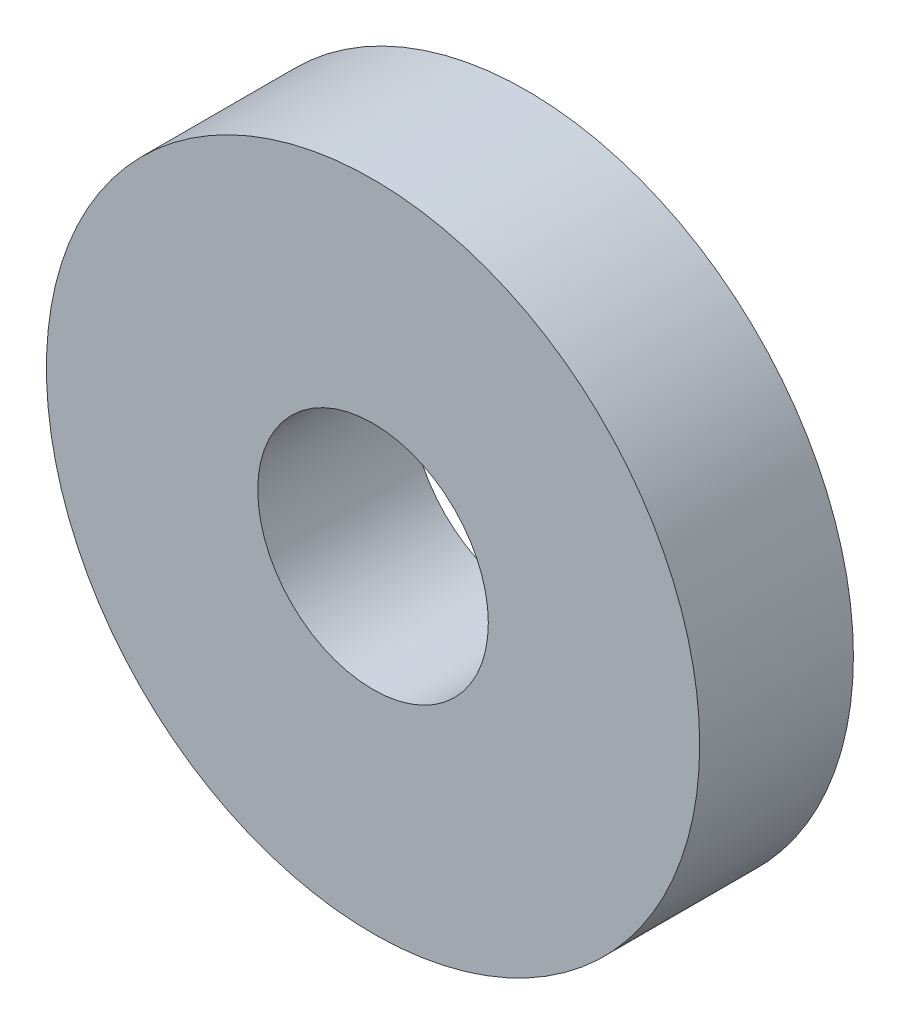
ISO-10303-21;
HEADER;
FILE_DESCRIPTION(('STEP AP214'),'2;1');
FILE_NAME('part.step','',(''),(''),'','','');
FILE_SCHEMA(('AUTOMOTIVE_DESIGN { 1 0 10303 214 1 1 1 1 }'));
ENDSEC;
DATA;
#1=APPLICATION_CONTEXT('core data for automotive mechanical design processes');
#2=APPLICATION_PROTOCOL_DEFINITION('international standard','automotive_design',2000,#1);
#3=PRODUCT_CONTEXT('',#1,'mechanical');
#4=PRODUCT('Part','Part','',(#3));
#5=PRODUCT_RELATED_PRODUCT_CATEGORY('part','',(#4));
#6=PRODUCT_DEFINITION_FORMATION('','',#4);
#7=PRODUCT_DEFINITION_CONTEXT('part definition',#1,'design');
#8=PRODUCT_DEFINITION('design','',#6,#7);
#9=PRODUCT_DEFINITION_SHAPE('','',#8);
#10=(LENGTH_UNIT() NAMED_UNIT(*) SI_UNIT(.MILLI.,.METRE.));
#11=(NAMED_UNIT(*) PLANE_ANGLE_UNIT() SI_UNIT($,.RADIAN.));
#12=(NAMED_UNIT(*) SI_UNIT($,.STERADIAN.) SOLID_ANGLE_UNIT());
#13=UNCERTAINTY_MEASURE_WITH_UNIT(LENGTH_MEASURE(1.E-05),#10,'distance_accuracy_value','');
#14=(GEOMETRIC_REPRESENTATION_CONTEXT(3) GLOBAL_UNCERTAINTY_ASSIGNED_CONTEXT((#13)) GLOBAL_UNIT_ASSIGNED_CONTEXT((#10,
#11,#12)) REPRESENTATION_CONTEXT('',''));
#15=CARTESIAN_POINT('',(0.,0.,0.));
#16=DIRECTION('',(0.,0.,1.));
#17=DIRECTION('',(1.,0.,0.));
#18=AXIS2_PLACEMENT_3D('',#15,#16,#17);
#19=CARTESIAN_POINT('',(0.,0.,4.));
#20=DIRECTION('',(0.,0.,1.));
#21=DIRECTION('',(1.,0.,0.));
#22=AXIS2_PLACEMENT_3D('',#19,#20,#21);
#23=PLANE('',#22);
#24=CARTESIAN_POINT('',(0.,0.,4.));
#25=DIRECTION('',(0.,0.,1.));
#26=DIRECTION('',(1.,0.,0.));
#27=AXIS2_PLACEMENT_3D('',#24,#25,#26);
#28=CIRCLE('',#27,8.5);
#29=CARTESIAN_POINT('',(8.5,0.,4.));
#30=VERTEX_POINT('',#29);
#31=EDGE_CURVE('E10',#30,#30,#28,.T.);
#32=ORIENTED_EDGE('',*,*,#31,.T.);
#33=EDGE_LOOP('',(#32));
#34=FACE_BOUND('',#33,.T.);
#35=CARTESIAN_POINT('',(0.,0.,4.));
#36=DIRECTION('',(0.,0.,1.));
#37=DIRECTION('',(1.,0.,0.));
#38=AXIS2_PLACEMENT_3D('',#35,#36,#37);
#39=CIRCLE('',#38,3.);
#40=CARTESIAN_POINT('',(3.,0.,4.));
#41=VERTEX_POINT('',#40);
#42=EDGE_CURVE('E42',#41,#41,#39,.T.);
#43=ORIENTED_EDGE('',*,*,#42,.F.);
#44=EDGE_LOOP('',(#43));
#45=FACE_BOUND('',#44,.T.);
#46=ADVANCED_FACE('F31',(#34,#45),#23,.T.);
#47=CARTESIAN_POINT('',(0.,0.,0.));
#48=DIRECTION('',(0.,0.,1.));
#49=DIRECTION('',(1.,0.,0.));
#50=AXIS2_PLACEMENT_3D('',#47,#48,#49);
#51=PLANE('',#50);
#52=CARTESIAN_POINT('',(0.,0.,0.));
#53=DIRECTION('',(0.,0.,1.));
#54=DIRECTION('',(1.,0.,0.));
#55=AXIS2_PLACEMENT_3D('',#52,#53,#54);
#56=CIRCLE('',#55,8.5);
#57=CARTESIAN_POINT('',(8.5,0.,0.));
#58=VERTEX_POINT('',#57);
#59=EDGE_CURVE('E35',#58,#58,#56,.T.);
#60=ORIENTED_EDGE('',*,*,#59,.F.);
#61=EDGE_LOOP('',(#60));
#62=FACE_BOUND('',#61,.T.);
#63=CARTESIAN_POINT('',(0.,0.,0.));
#64=DIRECTION('',(0.,0.,1.));
#65=DIRECTION('',(1.,0.,0.));
#66=AXIS2_PLACEMENT_3D('',#63,#64,#65);
#67=CIRCLE('',#66,3.);
#68=CARTESIAN_POINT('',(3.,0.,0.));
#69=VERTEX_POINT('',#68);
#70=EDGE_CURVE('E44',#69,#69,#67,.T.);
#71=ORIENTED_EDGE('',*,*,#70,.T.);
#72=EDGE_LOOP('',(#71));
#73=FACE_BOUND('',#72,.T.);
#74=ADVANCED_FACE('F54',(#62,#73),#51,.F.);
#75=CARTESIAN_POINT('',(0.,0.,4.));
#76=DIRECTION('',(0.,0.,-1.));
#77=DIRECTION('',(-1.,0.,0.));
#78=AXIS2_PLACEMENT_3D('',#75,#76,#77);
#79=CYLINDRICAL_SURFACE('',#78,8.5);
#80=ORIENTED_EDGE('',*,*,#31,.F.);
#81=EDGE_LOOP('',(#80));
#82=FACE_BOUND('',#81,.T.);
#83=ORIENTED_EDGE('',*,*,#59,.T.);
#84=EDGE_LOOP('',(#83));
#85=FACE_BOUND('',#84,.T.);
#86=ADVANCED_FACE('F33',(#82,#85),#79,.T.);
#87=CARTESIAN_POINT('',(0.,0.,4.));
#88=DIRECTION('',(0.,0.,-1.));
#89=DIRECTION('',(-1.,0.,0.));
#90=AXIS2_PLACEMENT_3D('',#87,#88,#89);
#91=CYLINDRICAL_SURFACE('',#90,3.);
#92=ORIENTED_EDGE('',*,*,#42,.T.);
#93=EDGE_LOOP('',(#92));
#94=FACE_BOUND('',#93,.T.);
#95=ORIENTED_EDGE('',*,*,#70,.F.);
#96=EDGE_LOOP('',(#95));
#97=FACE_BOUND('',#96,.T.);
#98=ADVANCED_FACE('F50',(#94,#97),#91,.F.);
#99=CLOSED_SHELL('',(#46,#74,#86,#98));
#100=MANIFOLD_SOLID_BREP('B2',#99);
#101=ADVANCED_BREP_SHAPE_REPRESENTATION('',(#18,#100),#14);
#102=SHAPE_DEFINITION_REPRESENTATION(#9,#101);
ENDSEC;
END-ISO-10303-21;
